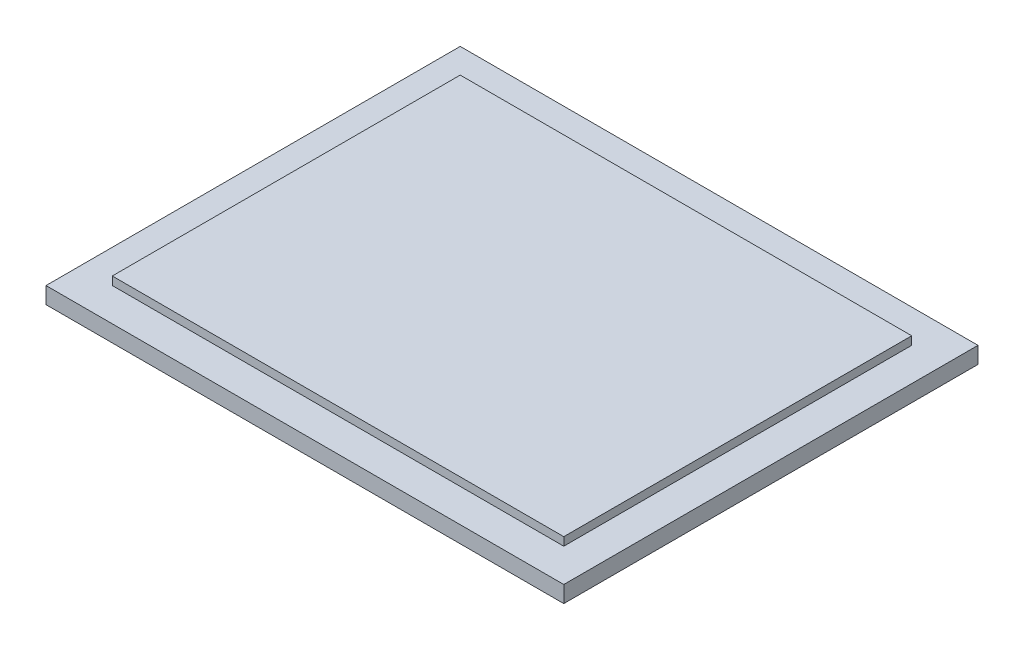
ISO-10303-21;
HEADER;
FILE_DESCRIPTION(('STEP AP214'),'2;1');
FILE_NAME('part.step','',(''),(''),'','','');
FILE_SCHEMA(('AUTOMOTIVE_DESIGN { 1 0 10303 214 1 1 1 1 }'));
ENDSEC;
DATA;
#1=APPLICATION_CONTEXT('core data for automotive mechanical design processes');
#2=APPLICATION_PROTOCOL_DEFINITION('international standard','automotive_design',2000,#1);
#3=PRODUCT_CONTEXT('',#1,'mechanical');
#4=PRODUCT('Part','Part','',(#3));
#5=PRODUCT_RELATED_PRODUCT_CATEGORY('part','',(#4));
#6=PRODUCT_DEFINITION_FORMATION('','',#4);
#7=PRODUCT_DEFINITION_CONTEXT('part definition',#1,'design');
#8=PRODUCT_DEFINITION('design','',#6,#7);
#9=PRODUCT_DEFINITION_SHAPE('','',#8);
#10=(LENGTH_UNIT() NAMED_UNIT(*) SI_UNIT(.MILLI.,.METRE.));
#11=(NAMED_UNIT(*) PLANE_ANGLE_UNIT() SI_UNIT($,.RADIAN.));
#12=(NAMED_UNIT(*) SI_UNIT($,.STERADIAN.) SOLID_ANGLE_UNIT());
#13=UNCERTAINTY_MEASURE_WITH_UNIT(LENGTH_MEASURE(1.E-05),#10,'distance_accuracy_value','');
#14=(GEOMETRIC_REPRESENTATION_CONTEXT(3) GLOBAL_UNCERTAINTY_ASSIGNED_CONTEXT((#13)) GLOBAL_UNIT_ASSIGNED_CONTEXT((#10,
#11,#12)) REPRESENTATION_CONTEXT('',''));
#15=CARTESIAN_POINT('',(0.,0.,0.));
#16=DIRECTION('',(0.,0.,1.));
#17=DIRECTION('',(1.,0.,0.));
#18=AXIS2_PLACEMENT_3D('',#15,#16,#17);
#19=CARTESIAN_POINT('',(0.,4.,0.));
#20=DIRECTION('',(0.,1.,0.));
#21=DIRECTION('',(0.,0.,1.));
#22=AXIS2_PLACEMENT_3D('',#19,#20,#21);
#23=PLANE('',#22);
#24=DIRECTION('',(0.,0.,1.));
#25=VECTOR('',#24,1.);
#26=CARTESIAN_POINT('',(-53.9957458281276,4.,-19.2062178282055));
#27=LINE('',#26,#25);
#28=CARTESIAN_POINT('',(-53.9957458281276,4.,-19.2062178282055));
#29=VERTEX_POINT('',#28);
#30=CARTESIAN_POINT('',(-53.9957458281276,4.,80.7937821717945));
#31=VERTEX_POINT('',#30);
#32=EDGE_CURVE('E140',#29,#31,#27,.T.);
#33=ORIENTED_EDGE('',*,*,#32,.T.);
#34=DIRECTION('',(1.,0.,0.));
#35=VECTOR('',#34,1.);
#36=CARTESIAN_POINT('',(-53.9957458281276,4.,80.7937821717945));
#37=LINE('',#36,#35);
#38=CARTESIAN_POINT('',(71.0042541718724,4.,80.7937821717945));
#39=VERTEX_POINT('',#38);
#40=EDGE_CURVE('E85',#31,#39,#37,.T.);
#41=ORIENTED_EDGE('',*,*,#40,.T.);
#42=DIRECTION('',(0.,0.,-1.));
#43=VECTOR('',#42,1.);
#44=CARTESIAN_POINT('',(71.0042541718724,4.,-19.2062178282055));
#45=LINE('',#44,#43);
#46=CARTESIAN_POINT('',(71.0042541718724,4.,-19.2062178282055));
#47=VERTEX_POINT('',#46);
#48=EDGE_CURVE('E143',#39,#47,#45,.T.);
#49=ORIENTED_EDGE('',*,*,#48,.T.);
#50=DIRECTION('',(-1.,0.,0.));
#51=VECTOR('',#50,1.);
#52=CARTESIAN_POINT('',(-53.9957458281276,4.,-19.2062178282055));
#53=LINE('',#52,#51);
#54=EDGE_CURVE('E57',#47,#29,#53,.T.);
#55=ORIENTED_EDGE('',*,*,#54,.T.);
#56=EDGE_LOOP('',(#33,#41,#49,#55));
#57=FACE_BOUND('',#56,.T.);
#58=DIRECTION('',(1.,0.,0.));
#59=VECTOR('',#58,1.);
#60=CARTESIAN_POINT('',(-45.9957458281276,4.,72.7937821717945));
#61=LINE('',#60,#59);
#62=CARTESIAN_POINT('',(-45.9957458281276,4.,72.7937821717945));
#63=VERTEX_POINT('',#62);
#64=CARTESIAN_POINT('',(63.0042541718724,4.,72.7937821717945));
#65=VERTEX_POINT('',#64);
#66=EDGE_CURVE('E263',#63,#65,#61,.T.);
#67=ORIENTED_EDGE('',*,*,#66,.F.);
#68=DIRECTION('',(0.,0.,1.));
#69=VECTOR('',#68,1.);
#70=CARTESIAN_POINT('',(-45.9957458281276,4.,72.7937821717945));
#71=LINE('',#70,#69);
#72=CARTESIAN_POINT('',(-45.9957458281276,4.,-11.2062178282055));
#73=VERTEX_POINT('',#72);
#74=EDGE_CURVE('E130',#73,#63,#71,.T.);
#75=ORIENTED_EDGE('',*,*,#74,.F.);
#76=DIRECTION('',(-1.,0.,0.));
#77=VECTOR('',#76,1.);
#78=CARTESIAN_POINT('',(-45.9957458281276,4.,-11.2062178282055));
#79=LINE('',#78,#77);
#80=CARTESIAN_POINT('',(63.0042541718724,4.,-11.2062178282055));
#81=VERTEX_POINT('',#80);
#82=EDGE_CURVE('E126',#81,#73,#79,.T.);
#83=ORIENTED_EDGE('',*,*,#82,.F.);
#84=DIRECTION('',(0.,0.,-1.));
#85=VECTOR('',#84,1.);
#86=CARTESIAN_POINT('',(63.0042541718724,4.,72.7937821717945));
#87=LINE('',#86,#85);
#88=EDGE_CURVE('E260',#65,#81,#87,.T.);
#89=ORIENTED_EDGE('',*,*,#88,.F.);
#90=EDGE_LOOP('',(#67,#75,#83,#89));
#91=FACE_BOUND('',#90,.T.);
#92=ADVANCED_FACE('F33',(#57,#91),#23,.T.);
#93=CARTESIAN_POINT('',(-53.9957458281276,4.,-19.2062178282055));
#94=DIRECTION('',(1.,0.,0.));
#95=DIRECTION('',(0.,0.,-1.));
#96=AXIS2_PLACEMENT_3D('',#93,#94,#95);
#97=PLANE('',#96);
#98=DIRECTION('',(0.,0.,1.));
#99=VECTOR('',#98,1.);
#100=CARTESIAN_POINT('',(-53.9957458281276,0.,-19.2062178282055));
#101=LINE('',#100,#99);
#102=CARTESIAN_POINT('',(-53.9957458281276,0.,-19.2062178282055));
#103=VERTEX_POINT('',#102);
#104=CARTESIAN_POINT('',(-53.9957458281276,0.,80.7937821717945));
#105=VERTEX_POINT('',#104);
#106=EDGE_CURVE('E132',#103,#105,#101,.T.);
#107=ORIENTED_EDGE('',*,*,#106,.T.);
#108=DIRECTION('',(0.,-1.,0.));
#109=VECTOR('',#108,1.);
#110=CARTESIAN_POINT('',(-53.9957458281276,4.,80.7937821717945));
#111=LINE('',#110,#109);
#112=EDGE_CURVE('E11',#31,#105,#111,.T.);
#113=ORIENTED_EDGE('',*,*,#112,.F.);
#114=ORIENTED_EDGE('',*,*,#32,.F.);
#115=DIRECTION('',(0.,-1.,0.));
#116=VECTOR('',#115,1.);
#117=CARTESIAN_POINT('',(-53.9957458281276,4.,-19.2062178282055));
#118=LINE('',#117,#116);
#119=EDGE_CURVE('E145',#29,#103,#118,.T.);
#120=ORIENTED_EDGE('',*,*,#119,.T.);
#121=EDGE_LOOP('',(#107,#113,#114,#120));
#122=FACE_BOUND('',#121,.T.);
#123=ADVANCED_FACE('F35',(#122),#97,.F.);
#124=CARTESIAN_POINT('',(-53.9957458281276,4.,80.7937821717945));
#125=DIRECTION('',(0.,0.,-1.));
#126=DIRECTION('',(-1.,0.,0.));
#127=AXIS2_PLACEMENT_3D('',#124,#125,#126);
#128=PLANE('',#127);
#129=DIRECTION('',(1.,0.,0.));
#130=VECTOR('',#129,1.);
#131=CARTESIAN_POINT('',(-53.9957458281276,0.,80.7937821717945));
#132=LINE('',#131,#130);
#133=CARTESIAN_POINT('',(71.0042541718724,0.,80.7937821717945));
#134=VERTEX_POINT('',#133);
#135=EDGE_CURVE('E135',#105,#134,#132,.T.);
#136=ORIENTED_EDGE('',*,*,#135,.T.);
#137=DIRECTION('',(0.,-1.,0.));
#138=VECTOR('',#137,1.);
#139=CARTESIAN_POINT('',(71.0042541718724,4.,80.7937821717945));
#140=LINE('',#139,#138);
#141=EDGE_CURVE('E41',#39,#134,#140,.T.);
#142=ORIENTED_EDGE('',*,*,#141,.F.);
#143=ORIENTED_EDGE('',*,*,#40,.F.);
#144=ORIENTED_EDGE('',*,*,#112,.T.);
#145=EDGE_LOOP('',(#136,#142,#143,#144));
#146=FACE_BOUND('',#145,.T.);
#147=ADVANCED_FACE('F173',(#146),#128,.F.);
#148=CARTESIAN_POINT('',(71.0042541718724,4.,-19.2062178282055));
#149=DIRECTION('',(-1.,0.,0.));
#150=DIRECTION('',(0.,0.,1.));
#151=AXIS2_PLACEMENT_3D('',#148,#149,#150);
#152=PLANE('',#151);
#153=DIRECTION('',(0.,0.,-1.));
#154=VECTOR('',#153,1.);
#155=CARTESIAN_POINT('',(71.0042541718724,0.,-19.2062178282055));
#156=LINE('',#155,#154);
#157=CARTESIAN_POINT('',(71.0042541718724,0.,-19.2062178282055));
#158=VERTEX_POINT('',#157);
#159=EDGE_CURVE('E148',#134,#158,#156,.T.);
#160=ORIENTED_EDGE('',*,*,#159,.T.);
#161=DIRECTION('',(0.,-1.,0.));
#162=VECTOR('',#161,1.);
#163=CARTESIAN_POINT('',(71.0042541718724,4.,-19.2062178282055));
#164=LINE('',#163,#162);
#165=EDGE_CURVE('E152',#47,#158,#164,.T.);
#166=ORIENTED_EDGE('',*,*,#165,.F.);
#167=ORIENTED_EDGE('',*,*,#48,.F.);
#168=ORIENTED_EDGE('',*,*,#141,.T.);
#169=EDGE_LOOP('',(#160,#166,#167,#168));
#170=FACE_BOUND('',#169,.T.);
#171=ADVANCED_FACE('F157',(#170),#152,.F.);
#172=CARTESIAN_POINT('',(-53.9957458281276,4.,-19.2062178282055));
#173=DIRECTION('',(0.,0.,1.));
#174=DIRECTION('',(1.,0.,0.));
#175=AXIS2_PLACEMENT_3D('',#172,#173,#174);
#176=PLANE('',#175);
#177=DIRECTION('',(-1.,0.,0.));
#178=VECTOR('',#177,1.);
#179=CARTESIAN_POINT('',(-53.9957458281276,0.,-19.2062178282055));
#180=LINE('',#179,#178);
#181=EDGE_CURVE('E78',#158,#103,#180,.T.);
#182=ORIENTED_EDGE('',*,*,#181,.T.);
#183=ORIENTED_EDGE('',*,*,#119,.F.);
#184=ORIENTED_EDGE('',*,*,#54,.F.);
#185=ORIENTED_EDGE('',*,*,#165,.T.);
#186=EDGE_LOOP('',(#182,#183,#184,#185));
#187=FACE_BOUND('',#186,.T.);
#188=ADVANCED_FACE('F165',(#187),#176,.F.);
#189=CARTESIAN_POINT('',(0.,0.,0.));
#190=DIRECTION('',(0.,1.,0.));
#191=DIRECTION('',(0.,0.,1.));
#192=AXIS2_PLACEMENT_3D('',#189,#190,#191);
#193=PLANE('',#192);
#194=ORIENTED_EDGE('',*,*,#106,.F.);
#195=ORIENTED_EDGE('',*,*,#181,.F.);
#196=ORIENTED_EDGE('',*,*,#159,.F.);
#197=ORIENTED_EDGE('',*,*,#135,.F.);
#198=EDGE_LOOP('',(#194,#195,#196,#197));
#199=FACE_BOUND('',#198,.T.);
#200=ADVANCED_FACE('F161',(#199),#193,.F.);
#201=CARTESIAN_POINT('',(-45.9957458281276,6.,72.7937821717945));
#202=DIRECTION('',(1.,0.,0.));
#203=DIRECTION('',(0.,0.,-1.));
#204=AXIS2_PLACEMENT_3D('',#201,#202,#203);
#205=PLANE('',#204);
#206=ORIENTED_EDGE('',*,*,#74,.T.);
#207=DIRECTION('',(0.,-1.,0.));
#208=VECTOR('',#207,1.);
#209=CARTESIAN_POINT('',(-45.9957458281276,6.,72.7937821717945));
#210=LINE('',#209,#208);
#211=CARTESIAN_POINT('',(-45.9957458281276,6.,72.7937821717945));
#212=VERTEX_POINT('',#211);
#213=EDGE_CURVE('E111',#212,#63,#210,.T.);
#214=ORIENTED_EDGE('',*,*,#213,.F.);
#215=DIRECTION('',(0.,0.,1.));
#216=VECTOR('',#215,1.);
#217=CARTESIAN_POINT('',(-45.9957458281276,6.,72.7937821717945));
#218=LINE('',#217,#216);
#219=CARTESIAN_POINT('',(-45.9957458281276,6.,-11.2062178282055));
#220=VERTEX_POINT('',#219);
#221=EDGE_CURVE('E118',#220,#212,#218,.T.);
#222=ORIENTED_EDGE('',*,*,#221,.F.);
#223=DIRECTION('',(0.,-1.,0.));
#224=VECTOR('',#223,1.);
#225=CARTESIAN_POINT('',(-45.9957458281276,6.,-11.2062178282055));
#226=LINE('',#225,#224);
#227=EDGE_CURVE('E258',#220,#73,#226,.T.);
#228=ORIENTED_EDGE('',*,*,#227,.T.);
#229=EDGE_LOOP('',(#206,#214,#222,#228));
#230=FACE_BOUND('',#229,.T.);
#231=ADVANCED_FACE('F128',(#230),#205,.F.);
#232=CARTESIAN_POINT('',(-45.9957458281276,6.,72.7937821717945));
#233=DIRECTION('',(0.,0.,-1.));
#234=DIRECTION('',(-1.,0.,0.));
#235=AXIS2_PLACEMENT_3D('',#232,#233,#234);
#236=PLANE('',#235);
#237=ORIENTED_EDGE('',*,*,#66,.T.);
#238=DIRECTION('',(0.,-1.,0.));
#239=VECTOR('',#238,1.);
#240=CARTESIAN_POINT('',(63.0042541718724,6.,72.7937821717945));
#241=LINE('',#240,#239);
#242=CARTESIAN_POINT('',(63.0042541718724,6.,72.7937821717945));
#243=VERTEX_POINT('',#242);
#244=EDGE_CURVE('E114',#243,#65,#241,.T.);
#245=ORIENTED_EDGE('',*,*,#244,.F.);
#246=DIRECTION('',(1.,0.,0.));
#247=VECTOR('',#246,1.);
#248=CARTESIAN_POINT('',(-45.9957458281276,6.,72.7937821717945));
#249=LINE('',#248,#247);
#250=EDGE_CURVE('E107',#212,#243,#249,.T.);
#251=ORIENTED_EDGE('',*,*,#250,.F.);
#252=ORIENTED_EDGE('',*,*,#213,.T.);
#253=EDGE_LOOP('',(#237,#245,#251,#252));
#254=FACE_BOUND('',#253,.T.);
#255=ADVANCED_FACE('F109',(#254),#236,.F.);
#256=CARTESIAN_POINT('',(63.0042541718724,6.,72.7937821717945));
#257=DIRECTION('',(-1.,0.,0.));
#258=DIRECTION('',(0.,0.,1.));
#259=AXIS2_PLACEMENT_3D('',#256,#257,#258);
#260=PLANE('',#259);
#261=ORIENTED_EDGE('',*,*,#88,.T.);
#262=DIRECTION('',(0.,-1.,0.));
#263=VECTOR('',#262,1.);
#264=CARTESIAN_POINT('',(63.0042541718724,6.,-11.2062178282055));
#265=LINE('',#264,#263);
#266=CARTESIAN_POINT('',(63.0042541718724,6.,-11.2062178282055));
#267=VERTEX_POINT('',#266);
#268=EDGE_CURVE('E48',#267,#81,#265,.T.);
#269=ORIENTED_EDGE('',*,*,#268,.F.);
#270=DIRECTION('',(0.,0.,-1.));
#271=VECTOR('',#270,1.);
#272=CARTESIAN_POINT('',(63.0042541718724,6.,72.7937821717945));
#273=LINE('',#272,#271);
#274=EDGE_CURVE('E117',#243,#267,#273,.T.);
#275=ORIENTED_EDGE('',*,*,#274,.F.);
#276=ORIENTED_EDGE('',*,*,#244,.T.);
#277=EDGE_LOOP('',(#261,#269,#275,#276));
#278=FACE_BOUND('',#277,.T.);
#279=ADVANCED_FACE('F186',(#278),#260,.F.);
#280=CARTESIAN_POINT('',(-45.9957458281276,6.,-11.2062178282055));
#281=DIRECTION('',(0.,0.,1.));
#282=DIRECTION('',(1.,0.,0.));
#283=AXIS2_PLACEMENT_3D('',#280,#281,#282);
#284=PLANE('',#283);
#285=ORIENTED_EDGE('',*,*,#82,.T.);
#286=ORIENTED_EDGE('',*,*,#227,.F.);
#287=DIRECTION('',(-1.,0.,0.));
#288=VECTOR('',#287,1.);
#289=CARTESIAN_POINT('',(-45.9957458281276,6.,-11.2062178282055));
#290=LINE('',#289,#288);
#291=EDGE_CURVE('E122',#267,#220,#290,.T.);
#292=ORIENTED_EDGE('',*,*,#291,.F.);
#293=ORIENTED_EDGE('',*,*,#268,.T.);
#294=EDGE_LOOP('',(#285,#286,#292,#293));
#295=FACE_BOUND('',#294,.T.);
#296=ADVANCED_FACE('F189',(#295),#284,.F.);
#297=CARTESIAN_POINT('',(0.,6.,0.));
#298=DIRECTION('',(0.,-1.,0.));
#299=DIRECTION('',(0.,0.,-1.));
#300=AXIS2_PLACEMENT_3D('',#297,#298,#299);
#301=PLANE('',#300);
#302=ORIENTED_EDGE('',*,*,#221,.T.);
#303=ORIENTED_EDGE('',*,*,#250,.T.);
#304=ORIENTED_EDGE('',*,*,#274,.T.);
#305=ORIENTED_EDGE('',*,*,#291,.T.);
#306=EDGE_LOOP('',(#302,#303,#304,#305));
#307=FACE_BOUND('',#306,.T.);
#308=ADVANCED_FACE('F121',(#307),#301,.F.);
#309=CLOSED_SHELL('',(#92,#123,#147,#171,#188,#200,#231,#255,#279,#296,#308));
#310=MANIFOLD_SOLID_BREP('B2',#309);
#311=ADVANCED_BREP_SHAPE_REPRESENTATION('',(#18,#310),#14);
#312=SHAPE_DEFINITION_REPRESENTATION(#9,#311);
ENDSEC;
END-ISO-10303-21;
